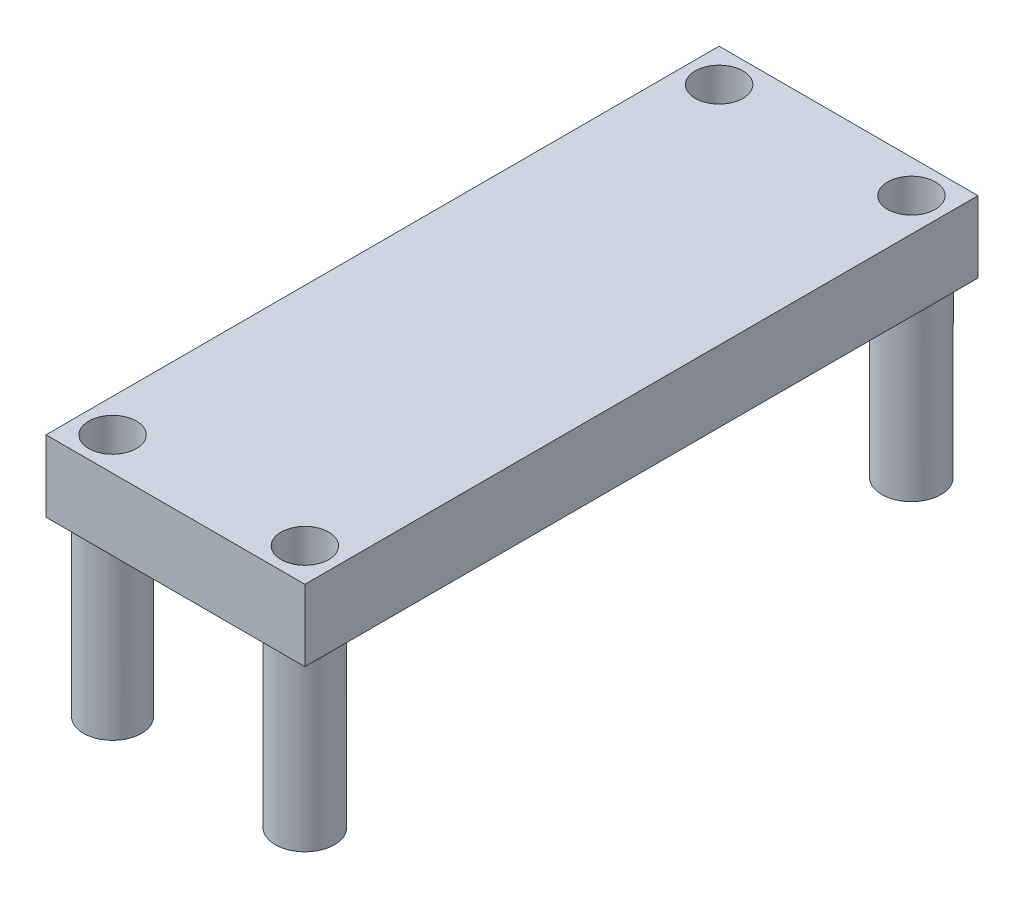
ISO-10303-21;
HEADER;
FILE_DESCRIPTION(('STEP AP214'),'2;1');
FILE_NAME('part.step','',(''),(''),'','','');
FILE_SCHEMA(('AUTOMOTIVE_DESIGN { 1 0 10303 214 1 1 1 1 }'));
ENDSEC;
DATA;
#1=APPLICATION_CONTEXT('core data for automotive mechanical design processes');
#2=APPLICATION_PROTOCOL_DEFINITION('international standard','automotive_design',2000,#1);
#3=PRODUCT_CONTEXT('',#1,'mechanical');
#4=PRODUCT('Part','Part','',(#3));
#5=PRODUCT_RELATED_PRODUCT_CATEGORY('part','',(#4));
#6=PRODUCT_DEFINITION_FORMATION('','',#4);
#7=PRODUCT_DEFINITION_CONTEXT('part definition',#1,'design');
#8=PRODUCT_DEFINITION('design','',#6,#7);
#9=PRODUCT_DEFINITION_SHAPE('','',#8);
#10=(LENGTH_UNIT() NAMED_UNIT(*) SI_UNIT(.MILLI.,.METRE.));
#11=(NAMED_UNIT(*) PLANE_ANGLE_UNIT() SI_UNIT($,.RADIAN.));
#12=(NAMED_UNIT(*) SI_UNIT($,.STERADIAN.) SOLID_ANGLE_UNIT());
#13=UNCERTAINTY_MEASURE_WITH_UNIT(LENGTH_MEASURE(1.E-05),#10,'distance_accuracy_value','');
#14=(GEOMETRIC_REPRESENTATION_CONTEXT(3) GLOBAL_UNCERTAINTY_ASSIGNED_CONTEXT((#13)) GLOBAL_UNIT_ASSIGNED_CONTEXT((#10,
#11,#12)) REPRESENTATION_CONTEXT('',''));
#15=CARTESIAN_POINT('',(0.,0.,0.));
#16=DIRECTION('',(0.,0.,1.));
#17=DIRECTION('',(1.,0.,0.));
#18=AXIS2_PLACEMENT_3D('',#15,#16,#17);
#19=CARTESIAN_POINT('',(-16.8639448621554,4.9022,-11.4760573934837));
#20=DIRECTION('',(1.,0.,0.));
#21=DIRECTION('',(0.,0.,-1.));
#22=AXIS2_PLACEMENT_3D('',#19,#20,#21);
#23=PLANE('',#22);
#24=DIRECTION('',(0.,0.,1.));
#25=VECTOR('',#24,1.);
#26=CARTESIAN_POINT('',(-16.8639448621554,0.,-11.4760573934837));
#27=LINE('',#26,#25);
#28=CARTESIAN_POINT('',(-16.8639448621554,0.,-11.4760573934837));
#29=VERTEX_POINT('',#28);
#30=CARTESIAN_POINT('',(-16.8639448621554,0.,34.7519426065163));
#31=VERTEX_POINT('',#30);
#32=EDGE_CURVE('E104',#29,#31,#27,.T.);
#33=ORIENTED_EDGE('',*,*,#32,.T.);
#34=DIRECTION('',(0.,-1.,0.));
#35=VECTOR('',#34,1.);
#36=CARTESIAN_POINT('',(-16.8639448621554,4.9022,34.7519426065163));
#37=LINE('',#36,#35);
#38=CARTESIAN_POINT('',(-16.8639448621554,4.9022,34.7519426065163));
#39=VERTEX_POINT('',#38);
#40=EDGE_CURVE('E95',#39,#31,#37,.T.);
#41=ORIENTED_EDGE('',*,*,#40,.F.);
#42=DIRECTION('',(0.,0.,1.));
#43=VECTOR('',#42,1.);
#44=CARTESIAN_POINT('',(-16.8639448621554,4.9022,-11.4760573934837));
#45=LINE('',#44,#43);
#46=CARTESIAN_POINT('',(-16.8639448621554,4.9022,-11.4760573934837));
#47=VERTEX_POINT('',#46);
#48=EDGE_CURVE('E89',#47,#39,#45,.T.);
#49=ORIENTED_EDGE('',*,*,#48,.F.);
#50=DIRECTION('',(0.,-1.,0.));
#51=VECTOR('',#50,1.);
#52=CARTESIAN_POINT('',(-16.8639448621554,4.9022,-11.4760573934837));
#53=LINE('',#52,#51);
#54=EDGE_CURVE('E100',#47,#29,#53,.T.);
#55=ORIENTED_EDGE('',*,*,#54,.T.);
#56=EDGE_LOOP('',(#33,#41,#49,#55));
#57=FACE_BOUND('',#56,.T.);
#58=ADVANCED_FACE('F37',(#57),#23,.F.);
#59=CARTESIAN_POINT('',(-16.8639448621554,4.9022,34.7519426065163));
#60=DIRECTION('',(0.,0.,-1.));
#61=DIRECTION('',(-1.,0.,0.));
#62=AXIS2_PLACEMENT_3D('',#59,#60,#61);
#63=PLANE('',#62);
#64=DIRECTION('',(1.,0.,0.));
#65=VECTOR('',#64,1.);
#66=CARTESIAN_POINT('',(-16.8639448621554,0.,34.7519426065163));
#67=LINE('',#66,#65);
#68=CARTESIAN_POINT('',(0.916055137844613,0.,34.7519426065163));
#69=VERTEX_POINT('',#68);
#70=EDGE_CURVE('E94',#31,#69,#67,.T.);
#71=ORIENTED_EDGE('',*,*,#70,.T.);
#72=DIRECTION('',(0.,-1.,0.));
#73=VECTOR('',#72,1.);
#74=CARTESIAN_POINT('',(0.916055137844613,4.9022,34.7519426065163));
#75=LINE('',#74,#73);
#76=CARTESIAN_POINT('',(0.916055137844613,4.9022,34.7519426065163));
#77=VERTEX_POINT('',#76);
#78=EDGE_CURVE('E92',#77,#69,#75,.T.);
#79=ORIENTED_EDGE('',*,*,#78,.F.);
#80=DIRECTION('',(1.,0.,0.));
#81=VECTOR('',#80,1.);
#82=CARTESIAN_POINT('',(-16.8639448621554,4.9022,34.7519426065163));
#83=LINE('',#82,#81);
#84=EDGE_CURVE('E84',#39,#77,#83,.T.);
#85=ORIENTED_EDGE('',*,*,#84,.F.);
#86=ORIENTED_EDGE('',*,*,#40,.T.);
#87=EDGE_LOOP('',(#71,#79,#85,#86));
#88=FACE_BOUND('',#87,.T.);
#89=ADVANCED_FACE('F93',(#88),#63,.F.);
#90=CARTESIAN_POINT('',(0.91605513784461,4.9022,-11.4760573934837));
#91=DIRECTION('',(-1.,0.,0.));
#92=DIRECTION('',(0.,0.,1.));
#93=AXIS2_PLACEMENT_3D('',#90,#91,#92);
#94=PLANE('',#93);
#95=DIRECTION('',(0.,0.,-1.));
#96=VECTOR('',#95,1.);
#97=CARTESIAN_POINT('',(0.91605513784461,0.,-11.4760573934837));
#98=LINE('',#97,#96);
#99=CARTESIAN_POINT('',(0.91605513784461,0.,-11.4760573934837));
#100=VERTEX_POINT('',#99);
#101=EDGE_CURVE('E70',#69,#100,#98,.T.);
#102=ORIENTED_EDGE('',*,*,#101,.T.);
#103=DIRECTION('',(0.,-1.,0.));
#104=VECTOR('',#103,1.);
#105=CARTESIAN_POINT('',(0.91605513784461,4.9022,-11.4760573934837));
#106=LINE('',#105,#104);
#107=CARTESIAN_POINT('',(0.91605513784461,4.9022,-11.4760573934837));
#108=VERTEX_POINT('',#107);
#109=EDGE_CURVE('E96',#108,#100,#106,.T.);
#110=ORIENTED_EDGE('',*,*,#109,.F.);
#111=DIRECTION('',(0.,0.,-1.));
#112=VECTOR('',#111,1.);
#113=CARTESIAN_POINT('',(0.91605513784461,4.9022,-11.4760573934837));
#114=LINE('',#113,#112);
#115=EDGE_CURVE('E87',#77,#108,#114,.T.);
#116=ORIENTED_EDGE('',*,*,#115,.F.);
#117=ORIENTED_EDGE('',*,*,#78,.T.);
#118=EDGE_LOOP('',(#102,#110,#116,#117));
#119=FACE_BOUND('',#118,.T.);
#120=ADVANCED_FACE('F98',(#119),#94,.F.);
#121=CARTESIAN_POINT('',(-16.8639448621554,4.9022,-11.4760573934837));
#122=DIRECTION('',(0.,0.,1.));
#123=DIRECTION('',(1.,0.,0.));
#124=AXIS2_PLACEMENT_3D('',#121,#122,#123);
#125=PLANE('',#124);
#126=DIRECTION('',(-1.,0.,0.));
#127=VECTOR('',#126,1.);
#128=CARTESIAN_POINT('',(-16.8639448621554,0.,-11.4760573934837));
#129=LINE('',#128,#127);
#130=EDGE_CURVE('E76',#100,#29,#129,.T.);
#131=ORIENTED_EDGE('',*,*,#130,.T.);
#132=ORIENTED_EDGE('',*,*,#54,.F.);
#133=DIRECTION('',(-1.,0.,0.));
#134=VECTOR('',#133,1.);
#135=CARTESIAN_POINT('',(-16.8639448621554,4.9022,-11.4760573934837));
#136=LINE('',#135,#134);
#137=EDGE_CURVE('E53',#108,#47,#136,.T.);
#138=ORIENTED_EDGE('',*,*,#137,.F.);
#139=ORIENTED_EDGE('',*,*,#109,.T.);
#140=EDGE_LOOP('',(#131,#132,#138,#139));
#141=FACE_BOUND('',#140,.T.);
#142=ADVANCED_FACE('F136',(#141),#125,.F.);
#143=CARTESIAN_POINT('',(0.,4.9022,0.));
#144=DIRECTION('',(0.,1.,0.));
#145=DIRECTION('',(0.,0.,1.));
#146=AXIS2_PLACEMENT_3D('',#143,#144,#145);
#147=PLANE('',#146);
#148=CARTESIAN_POINT('',(-1.36994486215539,4.9022,32.4659426065163));
#149=DIRECTION('',(0.,-1.,0.));
#150=DIRECTION('',(0.,0.,-1.));
#151=AXIS2_PLACEMENT_3D('',#148,#149,#150);
#152=CIRCLE('',#151,1.63830000000001);
#153=CARTESIAN_POINT('',(-1.36994486215539,4.9022,30.8276426065163));
#154=VERTEX_POINT('',#153);
#155=EDGE_CURVE('E373',#154,#154,#152,.T.);
#156=ORIENTED_EDGE('',*,*,#155,.T.);
#157=EDGE_LOOP('',(#156));
#158=FACE_BOUND('',#157,.T.);
#159=CARTESIAN_POINT('',(-1.36994486215539,4.9022,-9.19005739348371));
#160=DIRECTION('',(0.,-1.,0.));
#161=DIRECTION('',(0.,0.,-1.));
#162=AXIS2_PLACEMENT_3D('',#159,#160,#161);
#163=CIRCLE('',#162,1.6383);
#164=CARTESIAN_POINT('',(-1.36994486215539,4.9022,-10.8283573934837));
#165=VERTEX_POINT('',#164);
#166=EDGE_CURVE('E379',#165,#165,#163,.T.);
#167=ORIENTED_EDGE('',*,*,#166,.T.);
#168=EDGE_LOOP('',(#167));
#169=FACE_BOUND('',#168,.T.);
#170=CARTESIAN_POINT('',(-14.5779448621554,4.9022,-9.19005739348371));
#171=DIRECTION('',(0.,-1.,0.));
#172=DIRECTION('',(0.,0.,-1.));
#173=AXIS2_PLACEMENT_3D('',#170,#171,#172);
#174=CIRCLE('',#173,1.6383);
#175=CARTESIAN_POINT('',(-14.5779448621554,4.9022,-10.8283573934837));
#176=VERTEX_POINT('',#175);
#177=EDGE_CURVE('E348',#176,#176,#174,.T.);
#178=ORIENTED_EDGE('',*,*,#177,.T.);
#179=EDGE_LOOP('',(#178));
#180=FACE_BOUND('',#179,.T.);
#181=CARTESIAN_POINT('',(-14.5779448621554,4.9022,32.4659426065163));
#182=DIRECTION('',(0.,-1.,0.));
#183=DIRECTION('',(0.,0.,-1.));
#184=AXIS2_PLACEMENT_3D('',#181,#182,#183);
#185=CIRCLE('',#184,1.6383);
#186=CARTESIAN_POINT('',(-14.5779448621554,4.9022,30.8276426065163));
#187=VERTEX_POINT('',#186);
#188=EDGE_CURVE('E339',#187,#187,#185,.T.);
#189=ORIENTED_EDGE('',*,*,#188,.T.);
#190=EDGE_LOOP('',(#189));
#191=FACE_BOUND('',#190,.T.);
#192=ORIENTED_EDGE('',*,*,#48,.T.);
#193=ORIENTED_EDGE('',*,*,#84,.T.);
#194=ORIENTED_EDGE('',*,*,#115,.T.);
#195=ORIENTED_EDGE('',*,*,#137,.T.);
#196=EDGE_LOOP('',(#192,#193,#194,#195));
#197=FACE_BOUND('',#196,.T.);
#198=ADVANCED_FACE('F85',(#158,#169,#180,#191,#197),#147,.T.);
#199=CARTESIAN_POINT('',(0.,0.,0.));
#200=DIRECTION('',(0.,1.,0.));
#201=DIRECTION('',(0.,0.,1.));
#202=AXIS2_PLACEMENT_3D('',#199,#200,#201);
#203=PLANE('',#202);
#204=CARTESIAN_POINT('',(-14.5779448621554,0.,-9.19005739348371));
#205=DIRECTION('',(0.,1.,0.));
#206=DIRECTION('',(0.,0.,1.));
#207=AXIS2_PLACEMENT_3D('',#204,#205,#206);
#208=CIRCLE('',#207,2.032);
#209=CARTESIAN_POINT('',(-14.5779448621554,0.,-7.15805739348371));
#210=VERTEX_POINT('',#209);
#211=EDGE_CURVE('E11',#210,#210,#208,.F.);
#212=ORIENTED_EDGE('',*,*,#211,.F.);
#213=EDGE_LOOP('',(#212));
#214=FACE_BOUND('',#213,.T.);
#215=CARTESIAN_POINT('',(-1.36994486215539,0.,-9.19005739348371));
#216=DIRECTION('',(0.,1.,0.));
#217=DIRECTION('',(0.,0.,1.));
#218=AXIS2_PLACEMENT_3D('',#215,#216,#217);
#219=CIRCLE('',#218,2.032);
#220=CARTESIAN_POINT('',(-1.36994486215539,0.,-7.15805739348371));
#221=VERTEX_POINT('',#220);
#222=EDGE_CURVE('E45',#221,#221,#219,.F.);
#223=ORIENTED_EDGE('',*,*,#222,.F.);
#224=EDGE_LOOP('',(#223));
#225=FACE_BOUND('',#224,.T.);
#226=CARTESIAN_POINT('',(-1.36994486215539,0.,32.4659426065163));
#227=DIRECTION('',(0.,1.,0.));
#228=DIRECTION('',(0.,0.,1.));
#229=AXIS2_PLACEMENT_3D('',#226,#227,#228);
#230=CIRCLE('',#229,2.032);
#231=CARTESIAN_POINT('',(-1.36994486215539,0.,34.4979426065163));
#232=VERTEX_POINT('',#231);
#233=EDGE_CURVE('E117',#232,#232,#230,.F.);
#234=ORIENTED_EDGE('',*,*,#233,.F.);
#235=EDGE_LOOP('',(#234));
#236=FACE_BOUND('',#235,.T.);
#237=CARTESIAN_POINT('',(-14.5779448621554,0.,32.4659426065163));
#238=DIRECTION('',(0.,1.,0.));
#239=DIRECTION('',(0.,0.,1.));
#240=AXIS2_PLACEMENT_3D('',#237,#238,#239);
#241=CIRCLE('',#240,1.9939);
#242=CARTESIAN_POINT('',(-14.5779448621554,0.,34.4598426065163));
#243=VERTEX_POINT('',#242);
#244=EDGE_CURVE('E114',#243,#243,#241,.F.);
#245=ORIENTED_EDGE('',*,*,#244,.F.);
#246=EDGE_LOOP('',(#245));
#247=FACE_BOUND('',#246,.T.);
#248=ORIENTED_EDGE('',*,*,#32,.F.);
#249=ORIENTED_EDGE('',*,*,#130,.F.);
#250=ORIENTED_EDGE('',*,*,#101,.F.);
#251=ORIENTED_EDGE('',*,*,#70,.F.);
#252=EDGE_LOOP('',(#248,#249,#250,#251));
#253=FACE_BOUND('',#252,.T.);
#254=ADVANCED_FACE('F124',(#214,#225,#236,#247,#253),#203,.F.);
#255=CARTESIAN_POINT('',(-14.5779448621554,-11.8618,32.4659426065163));
#256=DIRECTION('',(0.,1.,0.));
#257=DIRECTION('',(0.,0.,1.));
#258=AXIS2_PLACEMENT_3D('',#255,#256,#257);
#259=CYLINDRICAL_SURFACE('',#258,1.9939);
#260=CARTESIAN_POINT('',(-14.5779448621554,-11.8618,32.4659426065163));
#261=DIRECTION('',(0.,-1.,0.));
#262=DIRECTION('',(0.,0.,-1.));
#263=AXIS2_PLACEMENT_3D('',#260,#261,#262);
#264=CIRCLE('',#263,1.9939);
#265=CARTESIAN_POINT('',(-14.5779448621554,-11.8618,30.4720426065163));
#266=VERTEX_POINT('',#265);
#267=EDGE_CURVE('E107',#266,#266,#264,.T.);
#268=ORIENTED_EDGE('',*,*,#267,.F.);
#269=EDGE_LOOP('',(#268));
#270=FACE_BOUND('',#269,.T.);
#271=ORIENTED_EDGE('',*,*,#244,.T.);
#272=EDGE_LOOP('',(#271));
#273=FACE_BOUND('',#272,.T.);
#274=ADVANCED_FACE('F127',(#270,#273),#259,.T.);
#275=CARTESIAN_POINT('',(-14.5779448621554,-11.8618,32.4659426065163));
#276=DIRECTION('',(0.,-1.,0.));
#277=DIRECTION('',(0.,0.,-1.));
#278=AXIS2_PLACEMENT_3D('',#275,#276,#277);
#279=PLANE('',#278);
#280=CARTESIAN_POINT('',(-14.5779448621554,-11.8618,32.4659426065163));
#281=DIRECTION('',(0.,-1.,0.));
#282=DIRECTION('',(0.,0.,-1.));
#283=AXIS2_PLACEMENT_3D('',#280,#281,#282);
#284=CIRCLE('',#283,1.6383);
#285=CARTESIAN_POINT('',(-14.5779448621554,-11.8618,30.8276426065163));
#286=VERTEX_POINT('',#285);
#287=EDGE_CURVE('E342',#286,#286,#284,.T.);
#288=ORIENTED_EDGE('',*,*,#287,.F.);
#289=EDGE_LOOP('',(#288));
#290=FACE_BOUND('',#289,.T.);
#291=ORIENTED_EDGE('',*,*,#267,.T.);
#292=EDGE_LOOP('',(#291));
#293=FACE_BOUND('',#292,.T.);
#294=ADVANCED_FACE('F179',(#290,#293),#279,.T.);
#295=CARTESIAN_POINT('',(-1.36994486215539,-11.8618,32.4659426065163));
#296=DIRECTION('',(0.,1.,0.));
#297=DIRECTION('',(0.,0.,1.));
#298=AXIS2_PLACEMENT_3D('',#295,#296,#297);
#299=CYLINDRICAL_SURFACE('',#298,2.032);
#300=CARTESIAN_POINT('',(-1.36994486215539,-11.8618,32.4659426065163));
#301=DIRECTION('',(0.,-1.,0.));
#302=DIRECTION('',(0.,0.,-1.));
#303=AXIS2_PLACEMENT_3D('',#300,#301,#302);
#304=CIRCLE('',#303,2.032);
#305=CARTESIAN_POINT('',(-1.36994486215539,-11.8618,30.4339426065163));
#306=VERTEX_POINT('',#305);
#307=EDGE_CURVE('E357',#306,#306,#304,.T.);
#308=ORIENTED_EDGE('',*,*,#307,.F.);
#309=EDGE_LOOP('',(#308));
#310=FACE_BOUND('',#309,.T.);
#311=ORIENTED_EDGE('',*,*,#233,.T.);
#312=EDGE_LOOP('',(#311));
#313=FACE_BOUND('',#312,.T.);
#314=ADVANCED_FACE('F188',(#310,#313),#299,.T.);
#315=CARTESIAN_POINT('',(-1.36994486215539,-11.8618,32.4659426065163));
#316=DIRECTION('',(0.,-1.,0.));
#317=DIRECTION('',(0.,0.,-1.));
#318=AXIS2_PLACEMENT_3D('',#315,#316,#317);
#319=PLANE('',#318);
#320=CARTESIAN_POINT('',(-1.36994486215539,-11.8618,32.4659426065163));
#321=DIRECTION('',(0.,-1.,0.));
#322=DIRECTION('',(0.,0.,-1.));
#323=AXIS2_PLACEMENT_3D('',#320,#321,#322);
#324=CIRCLE('',#323,1.63830000000001);
#325=CARTESIAN_POINT('',(-1.36994486215539,-11.8618,30.8276426065163));
#326=VERTEX_POINT('',#325);
#327=EDGE_CURVE('E376',#326,#326,#324,.T.);
#328=ORIENTED_EDGE('',*,*,#327,.F.);
#329=EDGE_LOOP('',(#328));
#330=FACE_BOUND('',#329,.T.);
#331=ORIENTED_EDGE('',*,*,#307,.T.);
#332=EDGE_LOOP('',(#331));
#333=FACE_BOUND('',#332,.T.);
#334=ADVANCED_FACE('F193',(#330,#333),#319,.T.);
#335=CARTESIAN_POINT('',(-1.36994486215539,-11.8618,-9.19005739348371));
#336=DIRECTION('',(0.,1.,0.));
#337=DIRECTION('',(0.,0.,1.));
#338=AXIS2_PLACEMENT_3D('',#335,#336,#337);
#339=CYLINDRICAL_SURFACE('',#338,2.032);
#340=CARTESIAN_POINT('',(-1.36994486215539,-11.8618,-9.19005739348371));
#341=DIRECTION('',(0.,-1.,0.));
#342=DIRECTION('',(0.,0.,-1.));
#343=AXIS2_PLACEMENT_3D('',#340,#341,#342);
#344=CIRCLE('',#343,2.032);
#345=CARTESIAN_POINT('',(-1.36994486215539,-11.8618,-11.2220573934837));
#346=VERTEX_POINT('',#345);
#347=EDGE_CURVE('E354',#346,#346,#344,.T.);
#348=ORIENTED_EDGE('',*,*,#347,.F.);
#349=EDGE_LOOP('',(#348));
#350=FACE_BOUND('',#349,.T.);
#351=ORIENTED_EDGE('',*,*,#222,.T.);
#352=EDGE_LOOP('',(#351));
#353=FACE_BOUND('',#352,.T.);
#354=ADVANCED_FACE('F122',(#350,#353),#339,.T.);
#355=CARTESIAN_POINT('',(-1.36994486215539,-11.8618,-9.19005739348371));
#356=DIRECTION('',(0.,-1.,0.));
#357=DIRECTION('',(0.,0.,-1.));
#358=AXIS2_PLACEMENT_3D('',#355,#356,#357);
#359=PLANE('',#358);
#360=CARTESIAN_POINT('',(-1.36994486215539,-11.8618,-9.19005739348371));
#361=DIRECTION('',(0.,-1.,0.));
#362=DIRECTION('',(0.,0.,-1.));
#363=AXIS2_PLACEMENT_3D('',#360,#361,#362);
#364=CIRCLE('',#363,1.6383);
#365=CARTESIAN_POINT('',(-1.36994486215539,-11.8618,-10.8283573934837));
#366=VERTEX_POINT('',#365);
#367=EDGE_CURVE('E382',#366,#366,#364,.T.);
#368=ORIENTED_EDGE('',*,*,#367,.F.);
#369=EDGE_LOOP('',(#368));
#370=FACE_BOUND('',#369,.T.);
#371=ORIENTED_EDGE('',*,*,#347,.T.);
#372=EDGE_LOOP('',(#371));
#373=FACE_BOUND('',#372,.T.);
#374=ADVANCED_FACE('F206',(#370,#373),#359,.T.);
#375=CARTESIAN_POINT('',(-14.5779448621554,-11.8618,-9.19005739348371));
#376=DIRECTION('',(0.,1.,0.));
#377=DIRECTION('',(0.,0.,1.));
#378=AXIS2_PLACEMENT_3D('',#375,#376,#377);
#379=CYLINDRICAL_SURFACE('',#378,2.032);
#380=CARTESIAN_POINT('',(-14.5779448621554,-11.8618,-9.19005739348371));
#381=DIRECTION('',(0.,-1.,0.));
#382=DIRECTION('',(0.,0.,-1.));
#383=AXIS2_PLACEMENT_3D('',#380,#381,#382);
#384=CIRCLE('',#383,2.032);
#385=CARTESIAN_POINT('',(-14.5779448621554,-11.8618,-11.2220573934837));
#386=VERTEX_POINT('',#385);
#387=EDGE_CURVE('E345',#386,#386,#384,.T.);
#388=ORIENTED_EDGE('',*,*,#387,.F.);
#389=EDGE_LOOP('',(#388));
#390=FACE_BOUND('',#389,.T.);
#391=ORIENTED_EDGE('',*,*,#211,.T.);
#392=EDGE_LOOP('',(#391));
#393=FACE_BOUND('',#392,.T.);
#394=ADVANCED_FACE('F215',(#390,#393),#379,.T.);
#395=CARTESIAN_POINT('',(-14.5779448621554,-11.8618,-9.19005739348371));
#396=DIRECTION('',(0.,-1.,0.));
#397=DIRECTION('',(0.,0.,-1.));
#398=AXIS2_PLACEMENT_3D('',#395,#396,#397);
#399=PLANE('',#398);
#400=CARTESIAN_POINT('',(-14.5779448621554,-11.8618,-9.19005739348371));
#401=DIRECTION('',(0.,-1.,0.));
#402=DIRECTION('',(0.,0.,-1.));
#403=AXIS2_PLACEMENT_3D('',#400,#401,#402);
#404=CIRCLE('',#403,1.6383);
#405=CARTESIAN_POINT('',(-14.5779448621554,-11.8618,-10.8283573934837));
#406=VERTEX_POINT('',#405);
#407=EDGE_CURVE('E343',#406,#406,#404,.T.);
#408=ORIENTED_EDGE('',*,*,#407,.F.);
#409=EDGE_LOOP('',(#408));
#410=FACE_BOUND('',#409,.T.);
#411=ORIENTED_EDGE('',*,*,#387,.T.);
#412=EDGE_LOOP('',(#411));
#413=FACE_BOUND('',#412,.T.);
#414=ADVANCED_FACE('F220',(#410,#413),#399,.T.);
#415=CARTESIAN_POINT('',(-14.5779448621554,4.9022,-9.19005739348371));
#416=DIRECTION('',(0.,-1.,0.));
#417=DIRECTION('',(0.,0.,-1.));
#418=AXIS2_PLACEMENT_3D('',#415,#416,#417);
#419=CYLINDRICAL_SURFACE('',#418,1.6383);
#420=ORIENTED_EDGE('',*,*,#177,.F.);
#421=EDGE_LOOP('',(#420));
#422=FACE_BOUND('',#421,.T.);
#423=ORIENTED_EDGE('',*,*,#407,.T.);
#424=EDGE_LOOP('',(#423));
#425=FACE_BOUND('',#424,.T.);
#426=ADVANCED_FACE('F261',(#422,#425),#419,.F.);
#427=CARTESIAN_POINT('',(-1.36994486215539,4.9022,-9.19005739348371));
#428=DIRECTION('',(0.,-1.,0.));
#429=DIRECTION('',(0.,0.,-1.));
#430=AXIS2_PLACEMENT_3D('',#427,#428,#429);
#431=CYLINDRICAL_SURFACE('',#430,1.6383);
#432=ORIENTED_EDGE('',*,*,#166,.F.);
#433=EDGE_LOOP('',(#432));
#434=FACE_BOUND('',#433,.T.);
#435=ORIENTED_EDGE('',*,*,#367,.T.);
#436=EDGE_LOOP('',(#435));
#437=FACE_BOUND('',#436,.T.);
#438=ADVANCED_FACE('F272',(#434,#437),#431,.F.);
#439=CARTESIAN_POINT('',(-1.36994486215539,4.9022,32.4659426065163));
#440=DIRECTION('',(0.,-1.,0.));
#441=DIRECTION('',(0.,0.,-1.));
#442=AXIS2_PLACEMENT_3D('',#439,#440,#441);
#443=CYLINDRICAL_SURFACE('',#442,1.63830000000001);
#444=ORIENTED_EDGE('',*,*,#155,.F.);
#445=EDGE_LOOP('',(#444));
#446=FACE_BOUND('',#445,.T.);
#447=ORIENTED_EDGE('',*,*,#327,.T.);
#448=EDGE_LOOP('',(#447));
#449=FACE_BOUND('',#448,.T.);
#450=ADVANCED_FACE('F283',(#446,#449),#443,.F.);
#451=CARTESIAN_POINT('',(-14.5779448621554,4.9022,32.4659426065163));
#452=DIRECTION('',(0.,-1.,0.));
#453=DIRECTION('',(0.,0.,-1.));
#454=AXIS2_PLACEMENT_3D('',#451,#452,#453);
#455=CYLINDRICAL_SURFACE('',#454,1.6383);
#456=ORIENTED_EDGE('',*,*,#188,.F.);
#457=EDGE_LOOP('',(#456));
#458=FACE_BOUND('',#457,.T.);
#459=ORIENTED_EDGE('',*,*,#287,.T.);
#460=EDGE_LOOP('',(#459));
#461=FACE_BOUND('',#460,.T.);
#462=ADVANCED_FACE('F294',(#458,#461),#455,.F.);
#463=CLOSED_SHELL('',(#58,#89,#120,#142,#198,#254,#274,#294,#314,#334,#354,#374,#394,#414,#426,
#438,#450,#462));
#464=MANIFOLD_SOLID_BREP('B2',#463);
#465=ADVANCED_BREP_SHAPE_REPRESENTATION('',(#18,#464),#14);
#466=SHAPE_DEFINITION_REPRESENTATION(#9,#465);
ENDSEC;
END-ISO-10303-21;
